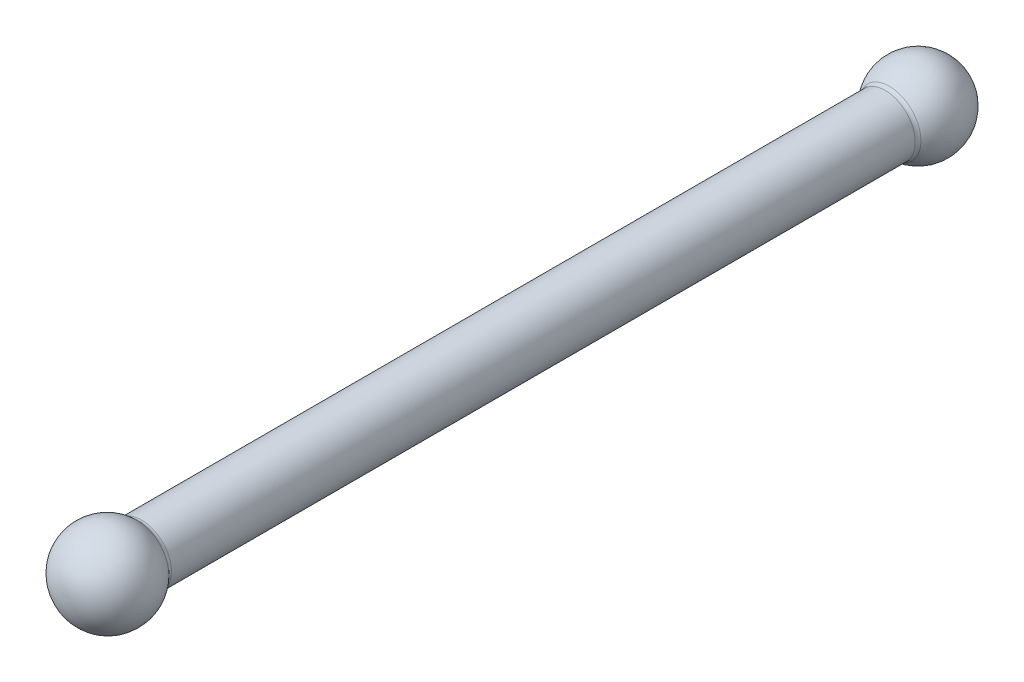
ISO-10303-21;
HEADER;
FILE_DESCRIPTION(('STEP AP214'),'2;1');
FILE_NAME('part.step','',(''),(''),'','','');
FILE_SCHEMA(('AUTOMOTIVE_DESIGN { 1 0 10303 214 1 1 1 1 }'));
ENDSEC;
DATA;
#1=APPLICATION_CONTEXT('core data for automotive mechanical design processes');
#2=APPLICATION_PROTOCOL_DEFINITION('international standard','automotive_design',2000,#1);
#3=PRODUCT_CONTEXT('',#1,'mechanical');
#4=PRODUCT('Part','Part','',(#3));
#5=PRODUCT_RELATED_PRODUCT_CATEGORY('part','',(#4));
#6=PRODUCT_DEFINITION_FORMATION('','',#4);
#7=PRODUCT_DEFINITION_CONTEXT('part definition',#1,'design');
#8=PRODUCT_DEFINITION('design','',#6,#7);
#9=PRODUCT_DEFINITION_SHAPE('','',#8);
#10=(LENGTH_UNIT() NAMED_UNIT(*) SI_UNIT(.MILLI.,.METRE.));
#11=(NAMED_UNIT(*) PLANE_ANGLE_UNIT() SI_UNIT($,.RADIAN.));
#12=(NAMED_UNIT(*) SI_UNIT($,.STERADIAN.) SOLID_ANGLE_UNIT());
#13=UNCERTAINTY_MEASURE_WITH_UNIT(LENGTH_MEASURE(1.E-05),#10,'distance_accuracy_value','');
#14=(GEOMETRIC_REPRESENTATION_CONTEXT(3) GLOBAL_UNCERTAINTY_ASSIGNED_CONTEXT((#13)) GLOBAL_UNIT_ASSIGNED_CONTEXT((#10,
#11,#12)) REPRESENTATION_CONTEXT('',''));
#15=CARTESIAN_POINT('',(0.,0.,0.));
#16=DIRECTION('',(0.,0.,1.));
#17=DIRECTION('',(1.,0.,0.));
#18=AXIS2_PLACEMENT_3D('',#15,#16,#17);
#19=CARTESIAN_POINT('',(0.110160946353632,55.0113867087952,21.5419188683717));
#20=DIRECTION('',(0.,-1.,0.));
#21=DIRECTION('',(1.,0.,0.));
#22=AXIS2_PLACEMENT_3D('',#19,#20,#21);
#23=CIRCLE('',#22,3.53872741991373);
#24=TRIMMED_CURVE('',#23,(PARAMETER_VALUE(-1.60193145916446)),
(PARAMETER_VALUE(1.60193145916446)),.T.,.PARAMETER.);
#25=CARTESIAN_POINT('',(0.,55.0113867087952,21.5419188683717));
#26=DIRECTION('',(0.,0.,1.));
#27=AXIS1_PLACEMENT('',#25,#26);
#28=SURFACE_OF_REVOLUTION('',#24,#27);
#29=CARTESIAN_POINT('',(0.,55.0113867087952,19.0622230212844));
#30=DIRECTION('',(0.,0.,1.));
#31=DIRECTION('',(1.,0.,0.));
#32=AXIS2_PLACEMENT_3D('',#29,#30,#31);
#33=CIRCLE('',#32,2.63477978063083);
#34=CARTESIAN_POINT('',(2.63477978063083,55.0113867087952,19.0622230212844));
#35=VERTEX_POINT('',#34);
#36=EDGE_CURVE('E11',#35,#35,#33,.T.);
#37=ORIENTED_EDGE('',*,*,#36,.T.);
#38=EDGE_LOOP('',(#37));
#39=FACE_BOUND('',#38,.T.);
#40=CARTESIAN_POINT('',(0.,55.0113867087952,25.0789312119108));
#41=VERTEX_POINT('',#40);
#42=VERTEX_LOOP('',#41);
#43=FACE_BOUND('',#42,.T.);
#44=ADVANCED_FACE('F36',(#39,#43),#28,.T.);
#45=CARTESIAN_POINT('',(0.,55.0113867087952,-45.8818207763759));
#46=DIRECTION('',(0.,0.,1.));
#47=DIRECTION('',(0.,1.,0.));
#48=AXIS2_PLACEMENT_3D('',#45,#46,#47);
#49=SPHERICAL_SURFACE('',#48,3.53872741991373);
#50=CARTESIAN_POINT('',(0.,55.0113867087952,-43.5041731579493));
#51=DIRECTION('',(0.,0.,-0.999999999999999));
#52=DIRECTION('',(-1.,0.,0.));
#53=AXIS2_PLACEMENT_3D('',#50,#51,#52);
#54=CIRCLE('',#53,2.6209508875672);
#55=CARTESIAN_POINT('',(-2.6209508875672,55.0113867087952,-43.5041731579493));
#56=VERTEX_POINT('',#55);
#57=EDGE_CURVE('E43',#56,#56,#54,.T.);
#58=ORIENTED_EDGE('',*,*,#57,.T.);
#59=EDGE_LOOP('',(#58));
#60=FACE_BOUND('',#59,.T.);
#61=ADVANCED_FACE('F47',(#60),#49,.T.);
#62=CARTESIAN_POINT('',(0.,55.0113867087952,6.57388092963412E-06));
#63=DIRECTION('',(0.,0.,1.));
#64=DIRECTION('',(1.,0.,0.));
#65=AXIS2_PLACEMENT_3D('',#62,#63,#64);
#66=CYLINDRICAL_SURFACE('',#65,2.4892);
#67=CARTESIAN_POINT('',(0.,55.0113867087952,-43.1628513077938));
#68=DIRECTION('',(0.,0.,-0.999999999999999));
#69=DIRECTION('',(-1.,0.,0.));
#70=AXIS2_PLACEMENT_3D('',#67,#68,#69);
#71=CIRCLE('',#70,2.4892);
#72=CARTESIAN_POINT('',(-2.4892,55.0113867087952,-43.1628513077938));
#73=VERTEX_POINT('',#72);
#74=EDGE_CURVE('E71',#73,#73,#71,.F.);
#75=ORIENTED_EDGE('',*,*,#74,.T.);
#76=EDGE_LOOP('',(#75));
#77=FACE_BOUND('',#76,.T.);
#78=CARTESIAN_POINT('',(0.,55.0113867087952,18.7062516957645));
#79=DIRECTION('',(0.,0.,1.));
#80=DIRECTION('',(1.,0.,0.));
#81=AXIS2_PLACEMENT_3D('',#78,#79,#80);
#82=CIRCLE('',#81,2.4892);
#83=CARTESIAN_POINT('',(2.4892,55.0113867087952,18.7062516957645));
#84=VERTEX_POINT('',#83);
#85=EDGE_CURVE('E72',#84,#84,#82,.F.);
#86=ORIENTED_EDGE('',*,*,#85,.T.);
#87=EDGE_LOOP('',(#86));
#88=FACE_BOUND('',#87,.T.);
#89=ADVANCED_FACE('F53',(#77,#88),#66,.T.);
#90=CARTESIAN_POINT('',(0.,55.0113867087952,-43.1628513077938));
#91=DIRECTION('',(0.,0.,-0.999999999999999));
#92=DIRECTION('',(-1.,0.,0.));
#93=AXIS2_PLACEMENT_3D('',#90,#91,#92);
#94=TOROIDAL_SURFACE('',#93,2.9972,0.508);
#95=ORIENTED_EDGE('',*,*,#57,.F.);
#96=EDGE_LOOP('',(#95));
#97=FACE_BOUND('',#96,.T.);
#98=ORIENTED_EDGE('',*,*,#74,.F.);
#99=EDGE_LOOP('',(#98));
#100=FACE_BOUND('',#99,.T.);
#101=ADVANCED_FACE('F57',(#97,#100),#94,.F.);
#102=CARTESIAN_POINT('',(0.,55.0113867087952,18.7062516957645));
#103=DIRECTION('',(0.,0.,1.));
#104=DIRECTION('',(1.,0.,0.));
#105=AXIS2_PLACEMENT_3D('',#102,#103,#104);
#106=TOROIDAL_SURFACE('',#105,2.9972,0.508);
#107=ORIENTED_EDGE('',*,*,#85,.F.);
#108=EDGE_LOOP('',(#107));
#109=FACE_BOUND('',#108,.T.);
#110=ORIENTED_EDGE('',*,*,#36,.F.);
#111=EDGE_LOOP('',(#110));
#112=FACE_BOUND('',#111,.T.);
#113=ADVANCED_FACE('F38',(#109,#112),#106,.F.);
#114=CLOSED_SHELL('',(#44,#61,#89,#101,#113));
#115=MANIFOLD_SOLID_BREP('B2',#114);
#116=ADVANCED_BREP_SHAPE_REPRESENTATION('',(#18,#115),#14);
#117=SHAPE_DEFINITION_REPRESENTATION(#9,#116);
ENDSEC;
END-ISO-10303-21;
